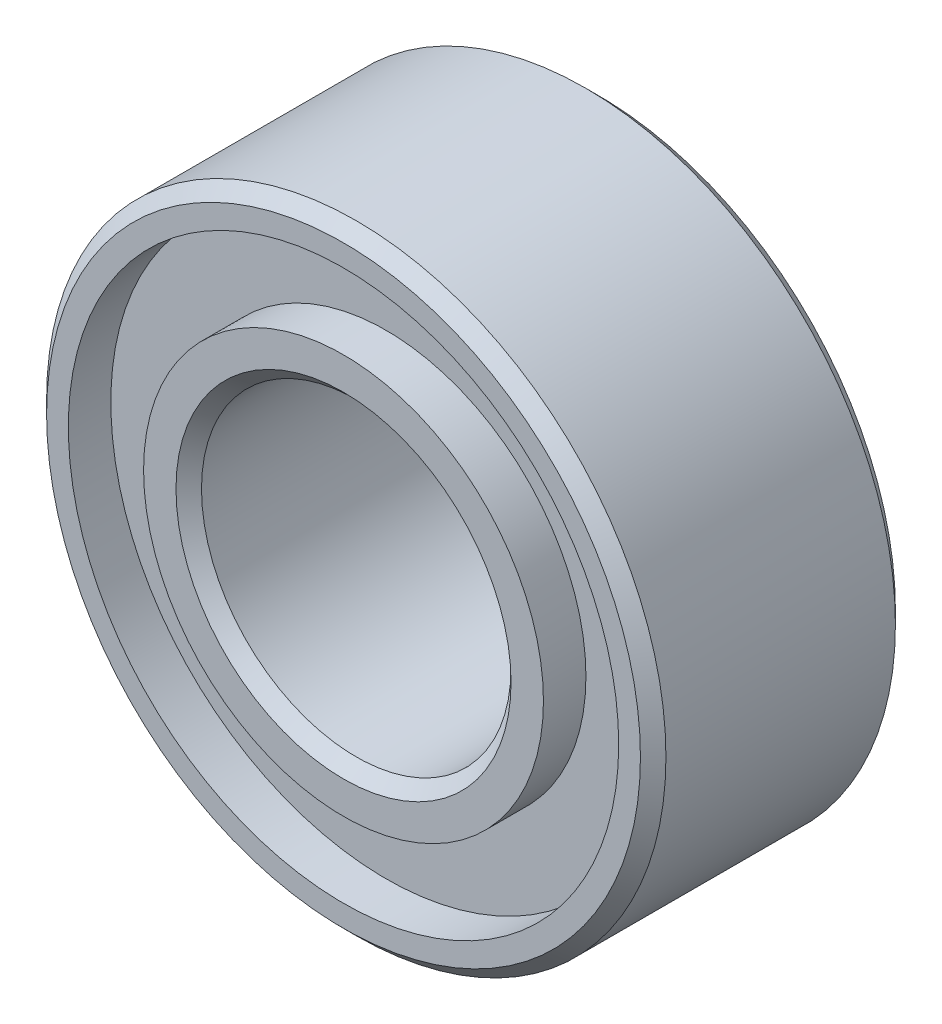
ISO-10303-21;
HEADER;
FILE_DESCRIPTION(('STEP AP214'),'2;1');
FILE_NAME('part.step','',(''),(''),'','','');
FILE_SCHEMA(('AUTOMOTIVE_DESIGN { 1 0 10303 214 1 1 1 1 }'));
ENDSEC;
DATA;
#1=APPLICATION_CONTEXT('core data for automotive mechanical design processes');
#2=APPLICATION_PROTOCOL_DEFINITION('international standard','automotive_design',2000,#1);
#3=PRODUCT_CONTEXT('',#1,'mechanical');
#4=PRODUCT('Part','Part','',(#3));
#5=PRODUCT_RELATED_PRODUCT_CATEGORY('part','',(#4));
#6=PRODUCT_DEFINITION_FORMATION('','',#4);
#7=PRODUCT_DEFINITION_CONTEXT('part definition',#1,'design');
#8=PRODUCT_DEFINITION('design','',#6,#7);
#9=PRODUCT_DEFINITION_SHAPE('','',#8);
#10=(LENGTH_UNIT() NAMED_UNIT(*) SI_UNIT(.MILLI.,.METRE.));
#11=(NAMED_UNIT(*) PLANE_ANGLE_UNIT() SI_UNIT($,.RADIAN.));
#12=(NAMED_UNIT(*) SI_UNIT($,.STERADIAN.) SOLID_ANGLE_UNIT());
#13=UNCERTAINTY_MEASURE_WITH_UNIT(LENGTH_MEASURE(1.E-05),#10,'distance_accuracy_value','');
#14=(GEOMETRIC_REPRESENTATION_CONTEXT(3) GLOBAL_UNCERTAINTY_ASSIGNED_CONTEXT((#13)) GLOBAL_UNIT_ASSIGNED_CONTEXT((#10,
#11,#12)) REPRESENTATION_CONTEXT('',''));
#15=CARTESIAN_POINT('',(0.,0.,0.));
#16=DIRECTION('',(0.,0.,1.));
#17=DIRECTION('',(1.,0.,0.));
#18=AXIS2_PLACEMENT_3D('',#15,#16,#17);
#19=CARTESIAN_POINT('',(0.,0.,0.823333333333329));
#20=DIRECTION('',(0.,0.,1.));
#21=DIRECTION('',(1.,0.,0.));
#22=AXIS2_PLACEMENT_3D('',#19,#20,#21);
#23=PLANE('',#22);
#24=CARTESIAN_POINT('',(0.,0.,0.823333333333329));
#25=DIRECTION('',(0.,0.,-1.));
#26=DIRECTION('',(-1.,0.,0.));
#27=AXIS2_PLACEMENT_3D('',#24,#25,#26);
#28=CIRCLE('',#27,5.33175000000001);
#29=CARTESIAN_POINT('',(-5.33175000000001,0.,0.823333333333329));
#30=VERTEX_POINT('',#29);
#31=EDGE_CURVE('E77',#30,#30,#28,.T.);
#32=ORIENTED_EDGE('',*,*,#31,.T.);
#33=EDGE_LOOP('',(#32));
#34=FACE_BOUND('',#33,.T.);
#35=CARTESIAN_POINT('',(0.,0.,0.823333333333329));
#36=DIRECTION('',(0.,0.,1.));
#37=DIRECTION('',(1.,0.,0.));
#38=AXIS2_PLACEMENT_3D('',#35,#36,#37);
#39=CIRCLE('',#38,3.873625);
#40=CARTESIAN_POINT('',(3.873625,0.,0.823333333333329));
#41=VERTEX_POINT('',#40);
#42=EDGE_CURVE('E62',#41,#41,#39,.F.);
#43=ORIENTED_EDGE('',*,*,#42,.F.);
#44=EDGE_LOOP('',(#43));
#45=FACE_BOUND('',#44,.T.);
#46=ADVANCED_FACE('F30',(#34,#45),#23,.F.);
#47=CARTESIAN_POINT('',(0.,0.,4.11666666666667));
#48=DIRECTION('',(0.,0.,-1.));
#49=DIRECTION('',(-1.,0.,0.));
#50=AXIS2_PLACEMENT_3D('',#47,#48,#49);
#51=PLANE('',#50);
#52=CARTESIAN_POINT('',(0.,0.,4.11666666666667));
#53=DIRECTION('',(0.,0.,1.));
#54=DIRECTION('',(1.,0.,0.));
#55=AXIS2_PLACEMENT_3D('',#52,#53,#54);
#56=CIRCLE('',#55,5.33175000000001);
#57=CARTESIAN_POINT('',(5.33175000000001,0.,4.11666666666667));
#58=VERTEX_POINT('',#57);
#59=EDGE_CURVE('E68',#58,#58,#56,.T.);
#60=ORIENTED_EDGE('',*,*,#59,.T.);
#61=EDGE_LOOP('',(#60));
#62=FACE_BOUND('',#61,.T.);
#63=CARTESIAN_POINT('',(0.,0.,4.11666666666667));
#64=DIRECTION('',(0.,0.,-1.));
#65=DIRECTION('',(-1.,0.,0.));
#66=AXIS2_PLACEMENT_3D('',#63,#64,#65);
#67=CIRCLE('',#66,3.873625);
#68=CARTESIAN_POINT('',(-3.873625,0.,4.11666666666667));
#69=VERTEX_POINT('',#68);
#70=EDGE_CURVE('E65',#69,#69,#67,.F.);
#71=ORIENTED_EDGE('',*,*,#70,.F.);
#72=EDGE_LOOP('',(#71));
#73=FACE_BOUND('',#72,.T.);
#74=ADVANCED_FACE('F97',(#62,#73),#51,.F.);
#75=CARTESIAN_POINT('',(0.,0.,0.));
#76=DIRECTION('',(0.,0.,1.));
#77=DIRECTION('',(1.,0.,0.));
#78=AXIS2_PLACEMENT_3D('',#75,#76,#77);
#79=CYLINDRICAL_SURFACE('',#78,6.);
#80=CARTESIAN_POINT('',(0.,0.,0.247000000058232));
#81=DIRECTION('',(0.,0.,-1.));
#82=DIRECTION('',(-1.,0.,0.));
#83=AXIS2_PLACEMENT_3D('',#80,#81,#82);
#84=CIRCLE('',#83,6.);
#85=CARTESIAN_POINT('',(-6.,0.,0.247000000058232));
#86=VERTEX_POINT('',#85);
#87=EDGE_CURVE('E41',#86,#86,#84,.F.);
#88=ORIENTED_EDGE('',*,*,#87,.T.);
#89=EDGE_LOOP('',(#88));
#90=FACE_BOUND('',#89,.T.);
#91=CARTESIAN_POINT('',(0.,0.,4.69299999994177));
#92=DIRECTION('',(0.,0.,-1.));
#93=DIRECTION('',(-1.,0.,0.));
#94=AXIS2_PLACEMENT_3D('',#91,#92,#93);
#95=CIRCLE('',#94,6.);
#96=CARTESIAN_POINT('',(-6.,0.,4.69299999994177));
#97=VERTEX_POINT('',#96);
#98=EDGE_CURVE('E45',#97,#97,#95,.T.);
#99=ORIENTED_EDGE('',*,*,#98,.T.);
#100=EDGE_LOOP('',(#99));
#101=FACE_BOUND('',#100,.T.);
#102=ADVANCED_FACE('F32',(#90,#101),#79,.T.);
#103=CARTESIAN_POINT('',(0.,0.,0.));
#104=DIRECTION('',(0.,0.,-1.));
#105=DIRECTION('',(-1.,0.,0.));
#106=AXIS2_PLACEMENT_3D('',#103,#104,#105);
#107=PLANE('',#106);
#108=CARTESIAN_POINT('',(0.,0.,0.));
#109=DIRECTION('',(0.,0.,-1.));
#110=DIRECTION('',(-1.,0.,0.));
#111=AXIS2_PLACEMENT_3D('',#108,#109,#110);
#112=CIRCLE('',#111,5.75299999994177);
#113=CARTESIAN_POINT('',(-5.75299999994177,0.,0.));
#114=VERTEX_POINT('',#113);
#115=EDGE_CURVE('E37',#114,#114,#112,.T.);
#116=ORIENTED_EDGE('',*,*,#115,.T.);
#117=EDGE_LOOP('',(#116));
#118=FACE_BOUND('',#117,.T.);
#119=CARTESIAN_POINT('',(0.,0.,0.));
#120=DIRECTION('',(0.,0.,-1.));
#121=DIRECTION('',(-1.,0.,0.));
#122=AXIS2_PLACEMENT_3D('',#119,#120,#121);
#123=CIRCLE('',#122,5.33175000000001);
#124=CARTESIAN_POINT('',(-5.33175000000001,0.,0.));
#125=VERTEX_POINT('',#124);
#126=EDGE_CURVE('E80',#125,#125,#123,.T.);
#127=ORIENTED_EDGE('',*,*,#126,.F.);
#128=EDGE_LOOP('',(#127));
#129=FACE_BOUND('',#128,.T.);
#130=ADVANCED_FACE('F121',(#118,#129),#107,.T.);
#131=CARTESIAN_POINT('',(0.,0.,4.94));
#132=DIRECTION('',(0.,0.,-1.));
#133=DIRECTION('',(-1.,0.,0.));
#134=AXIS2_PLACEMENT_3D('',#131,#132,#133);
#135=PLANE('',#134);
#136=CARTESIAN_POINT('',(0.,0.,4.94));
#137=DIRECTION('',(0.,0.,-1.));
#138=DIRECTION('',(-1.,0.,0.));
#139=AXIS2_PLACEMENT_3D('',#136,#137,#138);
#140=CIRCLE('',#139,5.75299999994177);
#141=CARTESIAN_POINT('',(-5.75299999994177,0.,4.94));
#142=VERTEX_POINT('',#141);
#143=EDGE_CURVE('E10',#142,#142,#140,.F.);
#144=ORIENTED_EDGE('',*,*,#143,.T.);
#145=EDGE_LOOP('',(#144));
#146=FACE_BOUND('',#145,.T.);
#147=CARTESIAN_POINT('',(0.,0.,4.94));
#148=DIRECTION('',(0.,0.,1.));
#149=DIRECTION('',(1.,0.,0.));
#150=AXIS2_PLACEMENT_3D('',#147,#148,#149);
#151=CIRCLE('',#150,5.33175000000001);
#152=CARTESIAN_POINT('',(5.33175000000001,0.,4.94));
#153=VERTEX_POINT('',#152);
#154=EDGE_CURVE('E71',#153,#153,#151,.T.);
#155=ORIENTED_EDGE('',*,*,#154,.F.);
#156=EDGE_LOOP('',(#155));
#157=FACE_BOUND('',#156,.T.);
#158=ADVANCED_FACE('F117',(#146,#157),#135,.F.);
#159=CARTESIAN_POINT('',(0.,0.,4.94));
#160=DIRECTION('',(0.,0.,1.));
#161=DIRECTION('',(1.,0.,0.));
#162=AXIS2_PLACEMENT_3D('',#159,#160,#161);
#163=CYLINDRICAL_SURFACE('',#162,5.33175000000001);
#164=ORIENTED_EDGE('',*,*,#59,.F.);
#165=EDGE_LOOP('',(#164));
#166=FACE_BOUND('',#165,.T.);
#167=ORIENTED_EDGE('',*,*,#154,.T.);
#168=EDGE_LOOP('',(#167));
#169=FACE_BOUND('',#168,.T.);
#170=ADVANCED_FACE('F114',(#166,#169),#163,.F.);
#171=CARTESIAN_POINT('',(0.,0.,4.94000000000001));
#172=DIRECTION('',(0.,0.,-1.));
#173=DIRECTION('',(-1.,0.,0.));
#174=AXIS2_PLACEMENT_3D('',#171,#172,#173);
#175=CYLINDRICAL_SURFACE('',#174,3.873625);
#176=CARTESIAN_POINT('',(0.,0.,4.94000000000001));
#177=DIRECTION('',(0.,0.,1.));
#178=DIRECTION('',(1.,0.,0.));
#179=AXIS2_PLACEMENT_3D('',#176,#177,#178);
#180=CIRCLE('',#179,3.873625);
#181=CARTESIAN_POINT('',(3.873625,0.,4.94000000000001));
#182=VERTEX_POINT('',#181);
#183=EDGE_CURVE('E74',#182,#182,#180,.T.);
#184=ORIENTED_EDGE('',*,*,#183,.F.);
#185=EDGE_LOOP('',(#184));
#186=FACE_BOUND('',#185,.T.);
#187=ORIENTED_EDGE('',*,*,#70,.T.);
#188=EDGE_LOOP('',(#187));
#189=FACE_BOUND('',#188,.T.);
#190=ADVANCED_FACE('F110',(#186,#189),#175,.T.);
#191=CARTESIAN_POINT('',(0.,0.,4.94000000000001));
#192=DIRECTION('',(0.,0.,1.));
#193=DIRECTION('',(1.,0.,0.));
#194=AXIS2_PLACEMENT_3D('',#191,#192,#193);
#195=PLANE('',#194);
#196=CARTESIAN_POINT('',(0.,0.,4.94000000000001));
#197=DIRECTION('',(0.,0.,1.));
#198=DIRECTION('',(1.,0.,0.));
#199=AXIS2_PLACEMENT_3D('',#196,#197,#198);
#200=CIRCLE('',#199,3.24575000005824);
#201=CARTESIAN_POINT('',(3.24575000005824,0.,4.94000000000001));
#202=VERTEX_POINT('',#201);
#203=EDGE_CURVE('E50',#202,#202,#200,.F.);
#204=ORIENTED_EDGE('',*,*,#203,.T.);
#205=EDGE_LOOP('',(#204));
#206=FACE_BOUND('',#205,.T.);
#207=ORIENTED_EDGE('',*,*,#183,.T.);
#208=EDGE_LOOP('',(#207));
#209=FACE_BOUND('',#208,.T.);
#210=ADVANCED_FACE('F107',(#206,#209),#195,.T.);
#211=CARTESIAN_POINT('',(0.,0.,0.));
#212=DIRECTION('',(0.,0.,-1.));
#213=DIRECTION('',(-1.,0.,0.));
#214=AXIS2_PLACEMENT_3D('',#211,#212,#213);
#215=CYLINDRICAL_SURFACE('',#214,5.33175000000001);
#216=ORIENTED_EDGE('',*,*,#31,.F.);
#217=EDGE_LOOP('',(#216));
#218=FACE_BOUND('',#217,.T.);
#219=ORIENTED_EDGE('',*,*,#126,.T.);
#220=EDGE_LOOP('',(#219));
#221=FACE_BOUND('',#220,.T.);
#222=ADVANCED_FACE('F92',(#218,#221),#215,.F.);
#223=CARTESIAN_POINT('',(0.,0.,0.));
#224=DIRECTION('',(0.,0.,1.));
#225=DIRECTION('',(1.,0.,0.));
#226=AXIS2_PLACEMENT_3D('',#223,#224,#225);
#227=CYLINDRICAL_SURFACE('',#226,3.873625);
#228=CARTESIAN_POINT('',(0.,0.,0.));
#229=DIRECTION('',(0.,0.,-1.));
#230=DIRECTION('',(-1.,0.,0.));
#231=AXIS2_PLACEMENT_3D('',#228,#229,#230);
#232=CIRCLE('',#231,3.873625);
#233=CARTESIAN_POINT('',(-3.873625,0.,0.));
#234=VERTEX_POINT('',#233);
#235=EDGE_CURVE('E83',#234,#234,#232,.T.);
#236=ORIENTED_EDGE('',*,*,#235,.F.);
#237=EDGE_LOOP('',(#236));
#238=FACE_BOUND('',#237,.T.);
#239=ORIENTED_EDGE('',*,*,#42,.T.);
#240=EDGE_LOOP('',(#239));
#241=FACE_BOUND('',#240,.T.);
#242=ADVANCED_FACE('F89',(#238,#241),#227,.T.);
#243=CARTESIAN_POINT('',(0.,0.,0.));
#244=DIRECTION('',(0.,0.,-1.));
#245=DIRECTION('',(-1.,0.,0.));
#246=AXIS2_PLACEMENT_3D('',#243,#244,#245);
#247=PLANE('',#246);
#248=CARTESIAN_POINT('',(0.,0.,0.));
#249=DIRECTION('',(0.,0.,-1.));
#250=DIRECTION('',(-1.,0.,0.));
#251=AXIS2_PLACEMENT_3D('',#248,#249,#250);
#252=CIRCLE('',#251,3.24575000005825);
#253=CARTESIAN_POINT('',(-3.24575000005825,0.,0.));
#254=VERTEX_POINT('',#253);
#255=EDGE_CURVE('E53',#254,#254,#252,.F.);
#256=ORIENTED_EDGE('',*,*,#255,.T.);
#257=EDGE_LOOP('',(#256));
#258=FACE_BOUND('',#257,.T.);
#259=ORIENTED_EDGE('',*,*,#235,.T.);
#260=EDGE_LOOP('',(#259));
#261=FACE_BOUND('',#260,.T.);
#262=ADVANCED_FACE('F87',(#258,#261),#247,.T.);
#263=CARTESIAN_POINT('',(0.,0.,0.));
#264=DIRECTION('',(0.,0.,-1.));
#265=DIRECTION('',(-1.,0.,0.));
#266=AXIS2_PLACEMENT_3D('',#263,#264,#265);
#267=CYLINDRICAL_SURFACE('',#266,2.99875000000001);
#268=CARTESIAN_POINT('',(0.,0.,0.24700000005823));
#269=DIRECTION('',(0.,0.,-1.));
#270=DIRECTION('',(-1.,0.,0.));
#271=AXIS2_PLACEMENT_3D('',#268,#269,#270);
#272=CIRCLE('',#271,2.99875000000001);
#273=CARTESIAN_POINT('',(-2.99875000000001,0.,0.24700000005823));
#274=VERTEX_POINT('',#273);
#275=EDGE_CURVE('E56',#274,#274,#272,.T.);
#276=ORIENTED_EDGE('',*,*,#275,.T.);
#277=EDGE_LOOP('',(#276));
#278=FACE_BOUND('',#277,.T.);
#279=CARTESIAN_POINT('',(0.,0.,4.69299999994178));
#280=DIRECTION('',(0.,0.,1.));
#281=DIRECTION('',(1.,0.,0.));
#282=AXIS2_PLACEMENT_3D('',#279,#280,#281);
#283=CIRCLE('',#282,2.99875000000001);
#284=CARTESIAN_POINT('',(2.99875000000001,0.,4.69299999994178));
#285=VERTEX_POINT('',#284);
#286=EDGE_CURVE('E59',#285,#285,#283,.T.);
#287=ORIENTED_EDGE('',*,*,#286,.T.);
#288=EDGE_LOOP('',(#287));
#289=FACE_BOUND('',#288,.T.);
#290=ADVANCED_FACE('F149',(#278,#289),#267,.F.);
#291=CARTESIAN_POINT('',(0.,0.,0.24700000005823));
#292=DIRECTION('',(0.,0.,-1.));
#293=DIRECTION('',(-1.,0.,0.));
#294=AXIS2_PLACEMENT_3D('',#291,#292,#293);
#295=CONICAL_SURFACE('',#294,2.99875000000001,0.785398163397456);
#296=ORIENTED_EDGE('',*,*,#255,.F.);
#297=EDGE_LOOP('',(#296));
#298=FACE_BOUND('',#297,.T.);
#299=ORIENTED_EDGE('',*,*,#275,.F.);
#300=EDGE_LOOP('',(#299));
#301=FACE_BOUND('',#300,.T.);
#302=ADVANCED_FACE('F157',(#298,#301),#295,.F.);
#303=CARTESIAN_POINT('',(0.,0.,4.69299999994178));
#304=DIRECTION('',(0.,0.,1.));
#305=DIRECTION('',(1.,0.,0.));
#306=AXIS2_PLACEMENT_3D('',#303,#304,#305);
#307=CONICAL_SURFACE('',#306,2.99875000000001,0.78539816339745);
#308=ORIENTED_EDGE('',*,*,#203,.F.);
#309=EDGE_LOOP('',(#308));
#310=FACE_BOUND('',#309,.T.);
#311=ORIENTED_EDGE('',*,*,#286,.F.);
#312=EDGE_LOOP('',(#311));
#313=FACE_BOUND('',#312,.T.);
#314=ADVANCED_FACE('F165',(#310,#313),#307,.F.);
#315=CARTESIAN_POINT('',(0.,0.,0.247000000058232));
#316=DIRECTION('',(0.,0.,1.));
#317=DIRECTION('',(1.,0.,0.));
#318=AXIS2_PLACEMENT_3D('',#315,#316,#317);
#319=CONICAL_SURFACE('',#318,6.,0.785398163397454);
#320=ORIENTED_EDGE('',*,*,#115,.F.);
#321=EDGE_LOOP('',(#320));
#322=FACE_BOUND('',#321,.T.);
#323=ORIENTED_EDGE('',*,*,#87,.F.);
#324=EDGE_LOOP('',(#323));
#325=FACE_BOUND('',#324,.T.);
#326=ADVANCED_FACE('F173',(#322,#325),#319,.T.);
#327=CARTESIAN_POINT('',(0.,0.,4.94));
#328=DIRECTION('',(0.,0.,-1.));
#329=DIRECTION('',(-1.,0.,0.));
#330=AXIS2_PLACEMENT_3D('',#327,#328,#329);
#331=CONICAL_SURFACE('',#330,5.75299999994177,0.785398163397441);
#332=ORIENTED_EDGE('',*,*,#98,.F.);
#333=EDGE_LOOP('',(#332));
#334=FACE_BOUND('',#333,.T.);
#335=ORIENTED_EDGE('',*,*,#143,.F.);
#336=EDGE_LOOP('',(#335));
#337=FACE_BOUND('',#336,.T.);
#338=ADVANCED_FACE('F181',(#334,#337),#331,.T.);
#339=CLOSED_SHELL('',(#46,#74,#102,#130,#158,#170,#190,#210,#222,#242,#262,#290,#302,#314,#326,#338));
#340=MANIFOLD_SOLID_BREP('B2',#339);
#341=ADVANCED_BREP_SHAPE_REPRESENTATION('',(#18,#340),#14);
#342=SHAPE_DEFINITION_REPRESENTATION(#9,#341);
ENDSEC;
END-ISO-10303-21;
